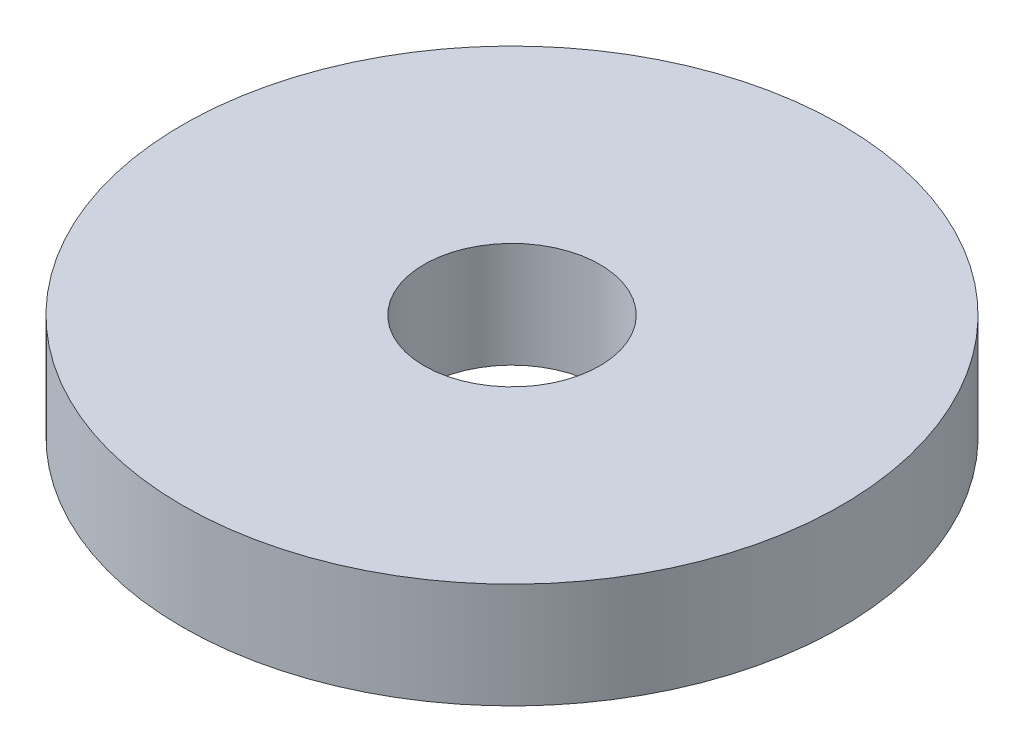
ISO-10303-21;
HEADER;
FILE_DESCRIPTION(('STEP AP214'),'2;1');
FILE_NAME('part.step','',(''),(''),'','','');
FILE_SCHEMA(('AUTOMOTIVE_DESIGN { 1 0 10303 214 1 1 1 1 }'));
ENDSEC;
DATA;
#1=APPLICATION_CONTEXT('core data for automotive mechanical design processes');
#2=APPLICATION_PROTOCOL_DEFINITION('international standard','automotive_design',2000,#1);
#3=PRODUCT_CONTEXT('',#1,'mechanical');
#4=PRODUCT('Part','Part','',(#3));
#5=PRODUCT_RELATED_PRODUCT_CATEGORY('part','',(#4));
#6=PRODUCT_DEFINITION_FORMATION('','',#4);
#7=PRODUCT_DEFINITION_CONTEXT('part definition',#1,'design');
#8=PRODUCT_DEFINITION('design','',#6,#7);
#9=PRODUCT_DEFINITION_SHAPE('','',#8);
#10=(LENGTH_UNIT() NAMED_UNIT(*) SI_UNIT(.MILLI.,.METRE.));
#11=(NAMED_UNIT(*) PLANE_ANGLE_UNIT() SI_UNIT($,.RADIAN.));
#12=(NAMED_UNIT(*) SI_UNIT($,.STERADIAN.) SOLID_ANGLE_UNIT());
#13=UNCERTAINTY_MEASURE_WITH_UNIT(LENGTH_MEASURE(1.E-05),#10,'distance_accuracy_value','');
#14=(GEOMETRIC_REPRESENTATION_CONTEXT(3) GLOBAL_UNCERTAINTY_ASSIGNED_CONTEXT((#13)) GLOBAL_UNIT_ASSIGNED_CONTEXT((#10,
#11,#12)) REPRESENTATION_CONTEXT('',''));
#15=CARTESIAN_POINT('',(0.,0.,0.));
#16=DIRECTION('',(0.,0.,1.));
#17=DIRECTION('',(1.,0.,0.));
#18=AXIS2_PLACEMENT_3D('',#15,#16,#17);
#19=CARTESIAN_POINT('',(0.,12.,0.));
#20=DIRECTION('',(0.,-1.,0.));
#21=DIRECTION('',(0.,0.,-1.));
#22=AXIS2_PLACEMENT_3D('',#19,#20,#21);
#23=CYLINDRICAL_SURFACE('',#22,37.5);
#24=CARTESIAN_POINT('',(0.,12.,0.));
#25=DIRECTION('',(0.,1.,0.));
#26=DIRECTION('',(0.,0.,1.));
#27=AXIS2_PLACEMENT_3D('',#24,#25,#26);
#28=CIRCLE('',#27,37.5);
#29=CARTESIAN_POINT('',(0.,12.,37.5));
#30=VERTEX_POINT('',#29);
#31=EDGE_CURVE('E10',#30,#30,#28,.T.);
#32=ORIENTED_EDGE('',*,*,#31,.F.);
#33=EDGE_LOOP('',(#32));
#34=FACE_BOUND('',#33,.T.);
#35=CARTESIAN_POINT('',(0.,0.,0.));
#36=DIRECTION('',(0.,1.,0.));
#37=DIRECTION('',(0.,0.,1.));
#38=AXIS2_PLACEMENT_3D('',#35,#36,#37);
#39=CIRCLE('',#38,37.5);
#40=CARTESIAN_POINT('',(0.,0.,37.5));
#41=VERTEX_POINT('',#40);
#42=EDGE_CURVE('E37',#41,#41,#39,.T.);
#43=ORIENTED_EDGE('',*,*,#42,.T.);
#44=EDGE_LOOP('',(#43));
#45=FACE_BOUND('',#44,.T.);
#46=ADVANCED_FACE('F40',(#34,#45),#23,.T.);
#47=CARTESIAN_POINT('',(0.,12.,0.));
#48=DIRECTION('',(0.,1.,0.));
#49=DIRECTION('',(0.,0.,1.));
#50=AXIS2_PLACEMENT_3D('',#47,#48,#49);
#51=PLANE('',#50);
#52=CARTESIAN_POINT('',(0.,12.,0.));
#53=DIRECTION('',(0.,1.,0.));
#54=DIRECTION('',(0.,0.,1.));
#55=AXIS2_PLACEMENT_3D('',#52,#53,#54);
#56=CIRCLE('',#55,10.);
#57=CARTESIAN_POINT('',(0.,12.,10.));
#58=VERTEX_POINT('',#57);
#59=EDGE_CURVE('E50',#58,#58,#56,.T.);
#60=ORIENTED_EDGE('',*,*,#59,.F.);
#61=EDGE_LOOP('',(#60));
#62=FACE_BOUND('',#61,.T.);
#63=ORIENTED_EDGE('',*,*,#31,.T.);
#64=EDGE_LOOP('',(#63));
#65=FACE_BOUND('',#64,.T.);
#66=ADVANCED_FACE('F59',(#62,#65),#51,.T.);
#67=CARTESIAN_POINT('',(0.,0.,0.));
#68=DIRECTION('',(0.,1.,0.));
#69=DIRECTION('',(0.,0.,1.));
#70=AXIS2_PLACEMENT_3D('',#67,#68,#69);
#71=PLANE('',#70);
#72=CARTESIAN_POINT('',(0.,0.,0.));
#73=DIRECTION('',(0.,1.,0.));
#74=DIRECTION('',(0.,0.,1.));
#75=AXIS2_PLACEMENT_3D('',#72,#73,#74);
#76=CIRCLE('',#75,10.);
#77=CARTESIAN_POINT('',(0.,0.,10.));
#78=VERTEX_POINT('',#77);
#79=EDGE_CURVE('E47',#78,#78,#76,.T.);
#80=ORIENTED_EDGE('',*,*,#79,.T.);
#81=EDGE_LOOP('',(#80));
#82=FACE_BOUND('',#81,.T.);
#83=ORIENTED_EDGE('',*,*,#42,.F.);
#84=EDGE_LOOP('',(#83));
#85=FACE_BOUND('',#84,.T.);
#86=ADVANCED_FACE('F58',(#82,#85),#71,.F.);
#87=CARTESIAN_POINT('',(0.,12.,0.));
#88=DIRECTION('',(0.,-1.,0.));
#89=DIRECTION('',(0.,0.,-1.));
#90=AXIS2_PLACEMENT_3D('',#87,#88,#89);
#91=CYLINDRICAL_SURFACE('',#90,10.);
#92=ORIENTED_EDGE('',*,*,#59,.T.);
#93=EDGE_LOOP('',(#92));
#94=FACE_BOUND('',#93,.T.);
#95=ORIENTED_EDGE('',*,*,#79,.F.);
#96=EDGE_LOOP('',(#95));
#97=FACE_BOUND('',#96,.T.);
#98=ADVANCED_FACE('F54',(#94,#97),#91,.F.);
#99=CLOSED_SHELL('',(#46,#66,#86,#98));
#100=MANIFOLD_SOLID_BREP('B2',#99);
#101=ADVANCED_BREP_SHAPE_REPRESENTATION('',(#18,#100),#14);
#102=SHAPE_DEFINITION_REPRESENTATION(#9,#101);
ENDSEC;
END-ISO-10303-21;
